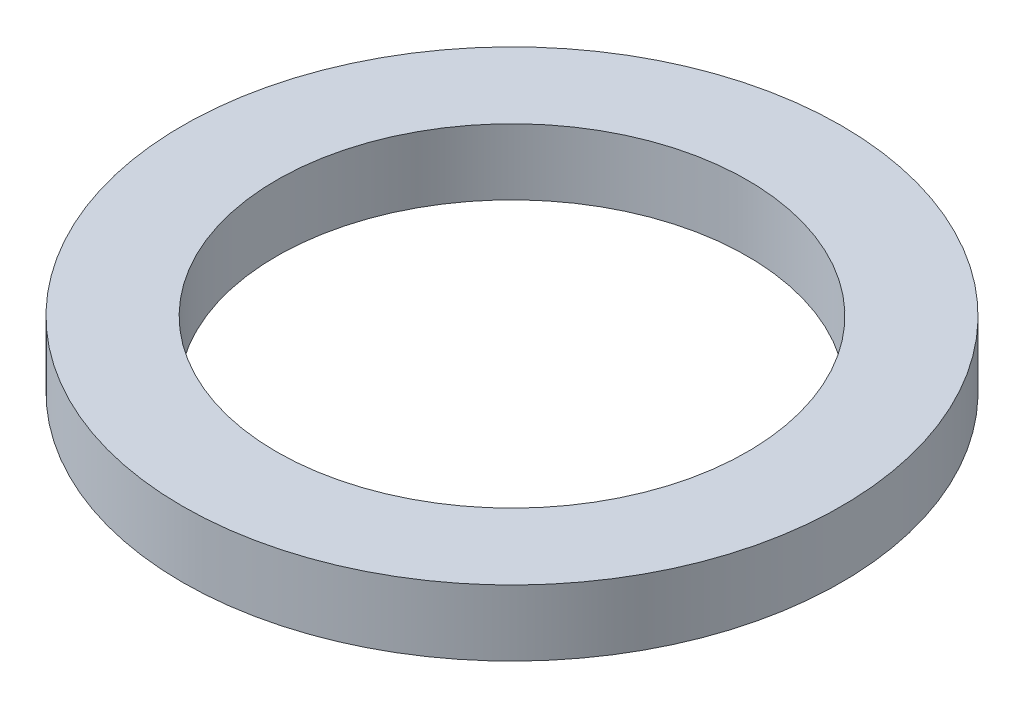
ISO-10303-21;
HEADER;
FILE_DESCRIPTION(('STEP AP214'),'2;1');
FILE_NAME('part.step','',(''),(''),'','','');
FILE_SCHEMA(('AUTOMOTIVE_DESIGN { 1 0 10303 214 1 1 1 1 }'));
ENDSEC;
DATA;
#1=APPLICATION_CONTEXT('core data for automotive mechanical design processes');
#2=APPLICATION_PROTOCOL_DEFINITION('international standard','automotive_design',2000,#1);
#3=PRODUCT_CONTEXT('',#1,'mechanical');
#4=PRODUCT('Part','Part','',(#3));
#5=PRODUCT_RELATED_PRODUCT_CATEGORY('part','',(#4));
#6=PRODUCT_DEFINITION_FORMATION('','',#4);
#7=PRODUCT_DEFINITION_CONTEXT('part definition',#1,'design');
#8=PRODUCT_DEFINITION('design','',#6,#7);
#9=PRODUCT_DEFINITION_SHAPE('','',#8);
#10=(LENGTH_UNIT() NAMED_UNIT(*) SI_UNIT(.MILLI.,.METRE.));
#11=(NAMED_UNIT(*) PLANE_ANGLE_UNIT() SI_UNIT($,.RADIAN.));
#12=(NAMED_UNIT(*) SI_UNIT($,.STERADIAN.) SOLID_ANGLE_UNIT());
#13=UNCERTAINTY_MEASURE_WITH_UNIT(LENGTH_MEASURE(1.E-05),#10,'distance_accuracy_value','');
#14=(GEOMETRIC_REPRESENTATION_CONTEXT(3) GLOBAL_UNCERTAINTY_ASSIGNED_CONTEXT((#13)) GLOBAL_UNIT_ASSIGNED_CONTEXT((#10,
#11,#12)) REPRESENTATION_CONTEXT('',''));
#15=CARTESIAN_POINT('',(0.,0.,0.));
#16=DIRECTION('',(0.,0.,1.));
#17=DIRECTION('',(1.,0.,0.));
#18=AXIS2_PLACEMENT_3D('',#15,#16,#17);
#19=CARTESIAN_POINT('',(0.,14.,0.));
#20=DIRECTION('',(0.,-1.,0.));
#21=DIRECTION('',(0.,0.,-1.));
#22=AXIS2_PLACEMENT_3D('',#19,#20,#21);
#23=CYLINDRICAL_SURFACE('',#22,70.);
#24=CARTESIAN_POINT('',(0.,14.,0.));
#25=DIRECTION('',(0.,1.,0.));
#26=DIRECTION('',(0.,0.,1.));
#27=AXIS2_PLACEMENT_3D('',#24,#25,#26);
#28=CIRCLE('',#27,70.);
#29=CARTESIAN_POINT('',(0.,14.,70.));
#30=VERTEX_POINT('',#29);
#31=EDGE_CURVE('E10',#30,#30,#28,.T.);
#32=ORIENTED_EDGE('',*,*,#31,.F.);
#33=EDGE_LOOP('',(#32));
#34=FACE_BOUND('',#33,.T.);
#35=CARTESIAN_POINT('',(0.,0.,0.));
#36=DIRECTION('',(0.,1.,0.));
#37=DIRECTION('',(0.,0.,1.));
#38=AXIS2_PLACEMENT_3D('',#35,#36,#37);
#39=CIRCLE('',#38,70.);
#40=CARTESIAN_POINT('',(0.,0.,70.));
#41=VERTEX_POINT('',#40);
#42=EDGE_CURVE('E37',#41,#41,#39,.T.);
#43=ORIENTED_EDGE('',*,*,#42,.T.);
#44=EDGE_LOOP('',(#43));
#45=FACE_BOUND('',#44,.T.);
#46=ADVANCED_FACE('F40',(#34,#45),#23,.T.);
#47=CARTESIAN_POINT('',(0.,14.,0.));
#48=DIRECTION('',(0.,1.,0.));
#49=DIRECTION('',(0.,0.,1.));
#50=AXIS2_PLACEMENT_3D('',#47,#48,#49);
#51=PLANE('',#50);
#52=CARTESIAN_POINT('',(0.,14.,0.));
#53=DIRECTION('',(0.,1.,0.));
#54=DIRECTION('',(0.,0.,1.));
#55=AXIS2_PLACEMENT_3D('',#52,#53,#54);
#56=CIRCLE('',#55,50.);
#57=CARTESIAN_POINT('',(0.,14.,50.));
#58=VERTEX_POINT('',#57);
#59=EDGE_CURVE('E50',#58,#58,#56,.T.);
#60=ORIENTED_EDGE('',*,*,#59,.F.);
#61=EDGE_LOOP('',(#60));
#62=FACE_BOUND('',#61,.T.);
#63=ORIENTED_EDGE('',*,*,#31,.T.);
#64=EDGE_LOOP('',(#63));
#65=FACE_BOUND('',#64,.T.);
#66=ADVANCED_FACE('F59',(#62,#65),#51,.T.);
#67=CARTESIAN_POINT('',(0.,0.,0.));
#68=DIRECTION('',(0.,1.,0.));
#69=DIRECTION('',(0.,0.,1.));
#70=AXIS2_PLACEMENT_3D('',#67,#68,#69);
#71=PLANE('',#70);
#72=CARTESIAN_POINT('',(0.,0.,0.));
#73=DIRECTION('',(0.,1.,0.));
#74=DIRECTION('',(0.,0.,1.));
#75=AXIS2_PLACEMENT_3D('',#72,#73,#74);
#76=CIRCLE('',#75,50.);
#77=CARTESIAN_POINT('',(0.,0.,50.));
#78=VERTEX_POINT('',#77);
#79=EDGE_CURVE('E47',#78,#78,#76,.T.);
#80=ORIENTED_EDGE('',*,*,#79,.T.);
#81=EDGE_LOOP('',(#80));
#82=FACE_BOUND('',#81,.T.);
#83=ORIENTED_EDGE('',*,*,#42,.F.);
#84=EDGE_LOOP('',(#83));
#85=FACE_BOUND('',#84,.T.);
#86=ADVANCED_FACE('F58',(#82,#85),#71,.F.);
#87=CARTESIAN_POINT('',(0.,14.,0.));
#88=DIRECTION('',(0.,-1.,0.));
#89=DIRECTION('',(0.,0.,-1.));
#90=AXIS2_PLACEMENT_3D('',#87,#88,#89);
#91=CYLINDRICAL_SURFACE('',#90,50.);
#92=ORIENTED_EDGE('',*,*,#59,.T.);
#93=EDGE_LOOP('',(#92));
#94=FACE_BOUND('',#93,.T.);
#95=ORIENTED_EDGE('',*,*,#79,.F.);
#96=EDGE_LOOP('',(#95));
#97=FACE_BOUND('',#96,.T.);
#98=ADVANCED_FACE('F54',(#94,#97),#91,.F.);
#99=CLOSED_SHELL('',(#46,#66,#86,#98));
#100=MANIFOLD_SOLID_BREP('B2',#99);
#101=ADVANCED_BREP_SHAPE_REPRESENTATION('',(#18,#100),#14);
#102=SHAPE_DEFINITION_REPRESENTATION(#9,#101);
ENDSEC;
END-ISO-10303-21;
